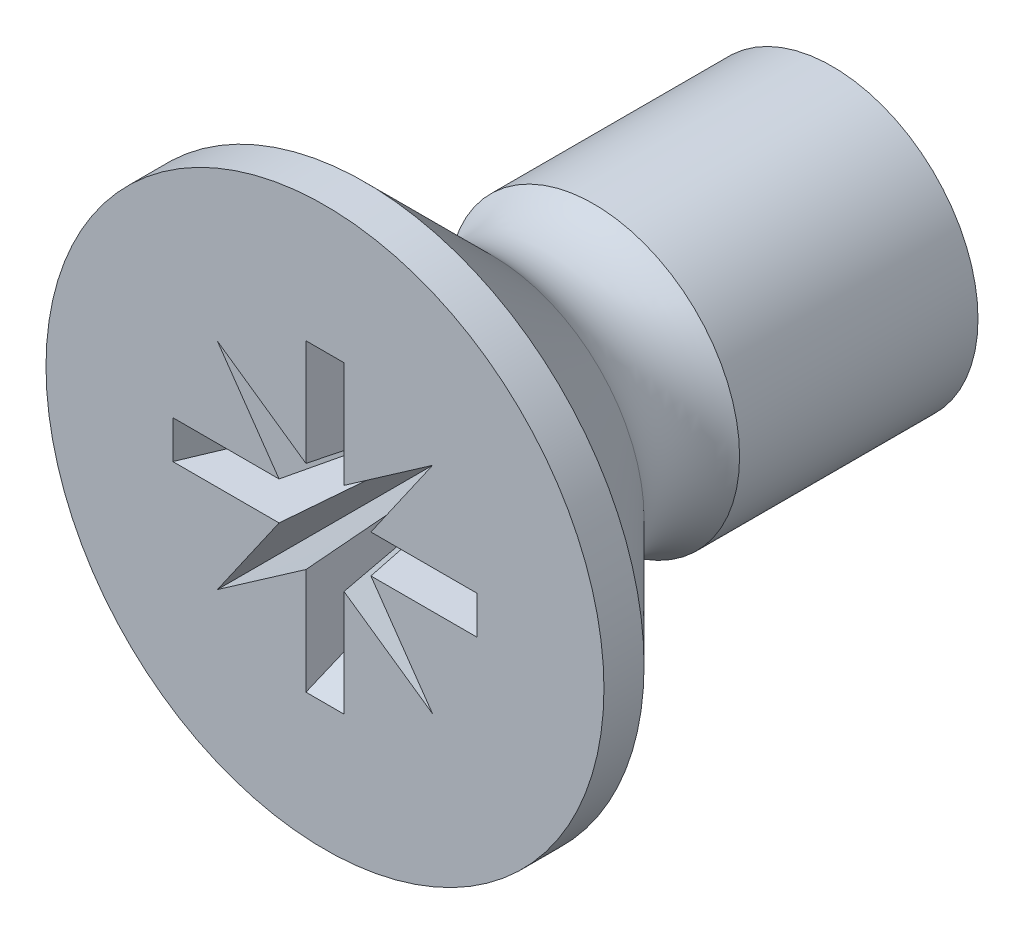
ISO-10303-21;
HEADER;
FILE_DESCRIPTION(('STEP AP214'),'2;1');
FILE_NAME('part.step','',(''),(''),'','','');
FILE_SCHEMA(('AUTOMOTIVE_DESIGN { 1 0 10303 214 1 1 1 1 }'));
ENDSEC;
DATA;
#1=APPLICATION_CONTEXT('core data for automotive mechanical design processes');
#2=APPLICATION_PROTOCOL_DEFINITION('international standard','automotive_design',2000,#1);
#3=PRODUCT_CONTEXT('',#1,'mechanical');
#4=PRODUCT('Part','Part','',(#3));
#5=PRODUCT_RELATED_PRODUCT_CATEGORY('part','',(#4));
#6=PRODUCT_DEFINITION_FORMATION('','',#4);
#7=PRODUCT_DEFINITION_CONTEXT('part definition',#1,'design');
#8=PRODUCT_DEFINITION('design','',#6,#7);
#9=PRODUCT_DEFINITION_SHAPE('','',#8);
#10=(LENGTH_UNIT() NAMED_UNIT(*) SI_UNIT(.MILLI.,.METRE.));
#11=(NAMED_UNIT(*) PLANE_ANGLE_UNIT() SI_UNIT($,.RADIAN.));
#12=(NAMED_UNIT(*) SI_UNIT($,.STERADIAN.) SOLID_ANGLE_UNIT());
#13=UNCERTAINTY_MEASURE_WITH_UNIT(LENGTH_MEASURE(1.E-05),#10,'distance_accuracy_value','');
#14=(GEOMETRIC_REPRESENTATION_CONTEXT(3) GLOBAL_UNCERTAINTY_ASSIGNED_CONTEXT((#13)) GLOBAL_UNIT_ASSIGNED_CONTEXT((#10,
#11,#12)) REPRESENTATION_CONTEXT('',''));
#15=CARTESIAN_POINT('',(0.,0.,0.));
#16=DIRECTION('',(0.,0.,1.));
#17=DIRECTION('',(1.,0.,0.));
#18=AXIS2_PLACEMENT_3D('',#15,#16,#17);
#19=CARTESIAN_POINT('',(0.,0.,-2.18276027382699));
#20=DIRECTION('',(0.,0.,-1.));
#21=DIRECTION('',(-1.,0.,0.));
#22=AXIS2_PLACEMENT_3D('',#19,#20,#21);
#23=TOROIDAL_SURFACE('',#22,2.02806180473974,0.753436804739738);
#24=CARTESIAN_POINT('',(0.,0.,-2.65));
#25=DIRECTION('',(0.,0.,-1.));
#26=DIRECTION('',(-1.,0.,0.));
#27=AXIS2_PLACEMENT_3D('',#24,#25,#26);
#28=CIRCLE('',#27,1.437);
#29=CARTESIAN_POINT('',(-1.437,0.,-2.65));
#30=VERTEX_POINT('',#29);
#31=EDGE_CURVE('E11',#30,#30,#28,.T.);
#32=ORIENTED_EDGE('',*,*,#31,.F.);
#33=EDGE_LOOP('',(#32));
#34=FACE_BOUND('',#33,.T.);
#35=CARTESIAN_POINT('',(0.,0.,-1.65));
#36=DIRECTION('',(0.,0.,-1.));
#37=DIRECTION('',(-1.,0.,0.));
#38=AXIS2_PLACEMENT_3D('',#35,#36,#37);
#39=CIRCLE('',#38,1.49530153091275);
#40=CARTESIAN_POINT('',(-1.49530153091275,0.,-1.65));
#41=VERTEX_POINT('',#40);
#42=EDGE_CURVE('E681',#41,#41,#39,.T.);
#43=ORIENTED_EDGE('',*,*,#42,.T.);
#44=EDGE_LOOP('',(#43));
#45=FACE_BOUND('',#44,.T.);
#46=ADVANCED_FACE('F17',(#34,#45),#23,.F.);
#47=CARTESIAN_POINT('',(0.,0.,0.));
#48=DIRECTION('',(0.,0.,-1.));
#49=DIRECTION('',(-1.,0.,0.));
#50=AXIS2_PLACEMENT_3D('',#47,#48,#49);
#51=CYLINDRICAL_SURFACE('',#50,1.437);
#52=CARTESIAN_POINT('',(0.,0.,-5.));
#53=DIRECTION('',(0.,0.,-1.));
#54=DIRECTION('',(-1.,0.,0.));
#55=AXIS2_PLACEMENT_3D('',#52,#53,#54);
#56=CIRCLE('',#55,1.437);
#57=CARTESIAN_POINT('',(-1.437,0.,-5.));
#58=VERTEX_POINT('',#57);
#59=EDGE_CURVE('E27',#58,#58,#56,.T.);
#60=ORIENTED_EDGE('',*,*,#59,.F.);
#61=EDGE_LOOP('',(#60));
#62=FACE_BOUND('',#61,.T.);
#63=ORIENTED_EDGE('',*,*,#31,.T.);
#64=EDGE_LOOP('',(#63));
#65=FACE_BOUND('',#64,.T.);
#66=ADVANCED_FACE('F671',(#62,#65),#51,.T.);
#67=CARTESIAN_POINT('',(0.,1.437,-5.));
#68=DIRECTION('',(0.,0.,1.));
#69=DIRECTION('',(1.,0.,0.));
#70=AXIS2_PLACEMENT_3D('',#67,#68,#69);
#71=PLANE('',#70);
#72=ORIENTED_EDGE('',*,*,#59,.T.);
#73=EDGE_LOOP('',(#72));
#74=FACE_BOUND('',#73,.T.);
#75=ADVANCED_FACE('F257',(#74),#71,.F.);
#76=CARTESIAN_POINT('',(0.,0.,0.));
#77=DIRECTION('',(0.,0.,-1.));
#78=DIRECTION('',(-1.,0.,0.));
#79=AXIS2_PLACEMENT_3D('',#76,#77,#78);
#80=PLANE('',#79);
#81=DIRECTION('',(0.,-1.,0.));
#82=VECTOR('',#81,1.);
#83=CARTESIAN_POINT('',(0.1875,-0.976332521472478,0.));
#84=LINE('',#83,#82);
#85=CARTESIAN_POINT('',(0.1875,-0.452665042944956,0.));
#86=VERTEX_POINT('',#85);
#87=CARTESIAN_POINT('',(0.1875,-1.5,0.));
#88=VERTEX_POINT('',#87);
#89=EDGE_CURVE('E177',#86,#88,#84,.T.);
#90=ORIENTED_EDGE('',*,*,#89,.T.);
#91=DIRECTION('',(-1.,0.,0.));
#92=VECTOR('',#91,1.);
#93=CARTESIAN_POINT('',(-0.09375,-1.5,0.));
#94=LINE('',#93,#92);
#95=CARTESIAN_POINT('',(-0.1875,-1.5,0.));
#96=VERTEX_POINT('',#95);
#97=EDGE_CURVE('E167',#88,#96,#94,.T.);
#98=ORIENTED_EDGE('',*,*,#97,.T.);
#99=DIRECTION('',(0.,1.,0.));
#100=VECTOR('',#99,1.);
#101=CARTESIAN_POINT('',(-0.1875,-0.976332521472478,0.));
#102=LINE('',#101,#100);
#103=CARTESIAN_POINT('',(-0.1875,-0.452665042944955,0.));
#104=VERTEX_POINT('',#103);
#105=EDGE_CURVE('E41',#96,#104,#102,.T.);
#106=ORIENTED_EDGE('',*,*,#105,.T.);
#107=CARTESIAN_POINT('',(-1.06066017177982,-1.06066017177982,0.));
#108=CARTESIAN_POINT('',(-0.1875,-0.452665042944956,0.));
#109=B_SPLINE_CURVE_WITH_KNOTS('',1,(#107,#108),.UNSPECIFIED.,.F.,.F.,(2,2),(0.,1.),.UNSPECIFIED.);
#110=CARTESIAN_POINT('',(-1.06066017177982,-1.06066017177982,0.));
#111=VERTEX_POINT('',#110);
#112=EDGE_CURVE('E527',#111,#104,#109,.T.);
#113=ORIENTED_EDGE('',*,*,#112,.F.);
#114=CARTESIAN_POINT('',(-0.452665042944956,-0.1875,0.));
#115=CARTESIAN_POINT('',(-1.06066017177982,-1.06066017177982,0.));
#116=B_SPLINE_CURVE_WITH_KNOTS('',1,(#114,#115),.UNSPECIFIED.,.F.,.F.,(2,2),(0.,1.),.UNSPECIFIED.);
#117=CARTESIAN_POINT('',(-0.452665042944956,-0.1875,0.));
#118=VERTEX_POINT('',#117);
#119=EDGE_CURVE('E546',#118,#111,#116,.T.);
#120=ORIENTED_EDGE('',*,*,#119,.F.);
#121=DIRECTION('',(-1.,0.,0.));
#122=VECTOR('',#121,1.);
#123=CARTESIAN_POINT('',(-0.976332521472478,-0.1875,0.));
#124=LINE('',#123,#122);
#125=CARTESIAN_POINT('',(-1.5,-0.1875,0.));
#126=VERTEX_POINT('',#125);
#127=EDGE_CURVE('E549',#118,#126,#124,.T.);
#128=ORIENTED_EDGE('',*,*,#127,.T.);
#129=DIRECTION('',(0.,1.,0.));
#130=VECTOR('',#129,1.);
#131=CARTESIAN_POINT('',(-1.5,-0.09375,0.));
#132=LINE('',#131,#130);
#133=CARTESIAN_POINT('',(-1.5,0.1875,0.));
#134=VERTEX_POINT('',#133);
#135=EDGE_CURVE('E565',#126,#134,#132,.T.);
#136=ORIENTED_EDGE('',*,*,#135,.T.);
#137=DIRECTION('',(1.,0.,0.));
#138=VECTOR('',#137,1.);
#139=CARTESIAN_POINT('',(-0.976332521472478,0.1875,0.));
#140=LINE('',#139,#138);
#141=CARTESIAN_POINT('',(-0.452665042944956,0.1875,0.));
#142=VERTEX_POINT('',#141);
#143=EDGE_CURVE('E588',#134,#142,#140,.T.);
#144=ORIENTED_EDGE('',*,*,#143,.T.);
#145=CARTESIAN_POINT('',(-1.06066017177982,1.06066017177982,0.));
#146=CARTESIAN_POINT('',(-0.452665042944956,0.1875,0.));
#147=B_SPLINE_CURVE_WITH_KNOTS('',1,(#145,#146),.UNSPECIFIED.,.F.,.F.,(2,2),(0.,1.),.UNSPECIFIED.);
#148=CARTESIAN_POINT('',(-1.06066017177982,1.06066017177982,0.));
#149=VERTEX_POINT('',#148);
#150=EDGE_CURVE('E596',#149,#142,#147,.T.);
#151=ORIENTED_EDGE('',*,*,#150,.F.);
#152=CARTESIAN_POINT('',(-0.1875,0.452665042944956,0.));
#153=CARTESIAN_POINT('',(-1.06066017177982,1.06066017177982,0.));
#154=B_SPLINE_CURVE_WITH_KNOTS('',1,(#152,#153),.UNSPECIFIED.,.F.,.F.,(2,2),(0.,1.),.UNSPECIFIED.);
#155=CARTESIAN_POINT('',(-0.1875,0.452665042944956,0.));
#156=VERTEX_POINT('',#155);
#157=EDGE_CURVE('E609',#156,#149,#154,.T.);
#158=ORIENTED_EDGE('',*,*,#157,.F.);
#159=DIRECTION('',(0.,1.,0.));
#160=VECTOR('',#159,1.);
#161=CARTESIAN_POINT('',(-0.1875,0.976332521472478,0.));
#162=LINE('',#161,#160);
#163=CARTESIAN_POINT('',(-0.1875,1.5,0.));
#164=VERTEX_POINT('',#163);
#165=EDGE_CURVE('E612',#156,#164,#162,.T.);
#166=ORIENTED_EDGE('',*,*,#165,.T.);
#167=DIRECTION('',(1.,0.,0.));
#168=VECTOR('',#167,1.);
#169=CARTESIAN_POINT('',(-0.09375,1.5,0.));
#170=LINE('',#169,#168);
#171=CARTESIAN_POINT('',(0.1875,1.5,0.));
#172=VERTEX_POINT('',#171);
#173=EDGE_CURVE('E629',#164,#172,#170,.T.);
#174=ORIENTED_EDGE('',*,*,#173,.T.);
#175=DIRECTION('',(0.,-1.,0.));
#176=VECTOR('',#175,1.);
#177=CARTESIAN_POINT('',(0.1875,0.976332521472478,0.));
#178=LINE('',#177,#176);
#179=CARTESIAN_POINT('',(0.1875,0.452665042944956,0.));
#180=VERTEX_POINT('',#179);
#181=EDGE_CURVE('E326',#172,#180,#178,.T.);
#182=ORIENTED_EDGE('',*,*,#181,.T.);
#183=CARTESIAN_POINT('',(1.06066017177982,1.06066017177982,0.));
#184=CARTESIAN_POINT('',(0.1875,0.452665042944956,0.));
#185=B_SPLINE_CURVE_WITH_KNOTS('',1,(#183,#184),.UNSPECIFIED.,.F.,.F.,(2,2),(0.,1.),.UNSPECIFIED.);
#186=CARTESIAN_POINT('',(1.06066017177982,1.06066017177982,0.));
#187=VERTEX_POINT('',#186);
#188=EDGE_CURVE('E303',#187,#180,#185,.T.);
#189=ORIENTED_EDGE('',*,*,#188,.F.);
#190=CARTESIAN_POINT('',(0.452665042944956,0.1875,0.));
#191=CARTESIAN_POINT('',(1.06066017177982,1.06066017177982,0.));
#192=B_SPLINE_CURVE_WITH_KNOTS('',1,(#190,#191),.UNSPECIFIED.,.F.,.F.,(2,2),(0.,1.),.UNSPECIFIED.);
#193=CARTESIAN_POINT('',(0.452665042944956,0.1875,0.));
#194=VERTEX_POINT('',#193);
#195=EDGE_CURVE('E297',#194,#187,#192,.T.);
#196=ORIENTED_EDGE('',*,*,#195,.F.);
#197=DIRECTION('',(1.,0.,0.));
#198=VECTOR('',#197,1.);
#199=CARTESIAN_POINT('',(0.976332521472478,0.1875,0.));
#200=LINE('',#199,#198);
#201=CARTESIAN_POINT('',(1.5,0.1875,0.));
#202=VERTEX_POINT('',#201);
#203=EDGE_CURVE('E300',#194,#202,#200,.T.);
#204=ORIENTED_EDGE('',*,*,#203,.T.);
#205=DIRECTION('',(0.,-1.,0.));
#206=VECTOR('',#205,1.);
#207=CARTESIAN_POINT('',(1.5,0.09375,0.));
#208=LINE('',#207,#206);
#209=CARTESIAN_POINT('',(1.5,-0.1875,0.));
#210=VERTEX_POINT('',#209);
#211=EDGE_CURVE('E497',#202,#210,#208,.T.);
#212=ORIENTED_EDGE('',*,*,#211,.T.);
#213=DIRECTION('',(-1.,0.,0.));
#214=VECTOR('',#213,1.);
#215=CARTESIAN_POINT('',(0.976332521472478,-0.1875,0.));
#216=LINE('',#215,#214);
#217=CARTESIAN_POINT('',(0.452665042944956,-0.1875,0.));
#218=VERTEX_POINT('',#217);
#219=EDGE_CURVE('E468',#210,#218,#216,.T.);
#220=ORIENTED_EDGE('',*,*,#219,.T.);
#221=CARTESIAN_POINT('',(1.06066017177982,-1.06066017177982,0.));
#222=CARTESIAN_POINT('',(0.452665042944956,-0.1875,0.));
#223=B_SPLINE_CURVE_WITH_KNOTS('',1,(#221,#222),.UNSPECIFIED.,.F.,.F.,(2,2),(0.,1.),.UNSPECIFIED.);
#224=CARTESIAN_POINT('',(1.06066017177982,-1.06066017177982,0.));
#225=VERTEX_POINT('',#224);
#226=EDGE_CURVE('E236',#225,#218,#223,.T.);
#227=ORIENTED_EDGE('',*,*,#226,.F.);
#228=CARTESIAN_POINT('',(0.1875,-0.452665042944956,0.));
#229=CARTESIAN_POINT('',(1.06066017177982,-1.06066017177982,0.));
#230=B_SPLINE_CURVE_WITH_KNOTS('',1,(#228,#229),.UNSPECIFIED.,.F.,.F.,(2,2),(0.,1.),.UNSPECIFIED.);
#231=EDGE_CURVE('E194',#86,#225,#230,.T.);
#232=ORIENTED_EDGE('',*,*,#231,.F.);
#233=EDGE_LOOP('',(#90,#98,#106,#113,#120,#128,#136,#144,#151,#158,#166,#174,#182,#189,#196,
#204,#212,#220,#227,#232));
#234=FACE_BOUND('',#233,.T.);
#235=CARTESIAN_POINT('',(0.,0.,0.));
#236=DIRECTION('',(0.,0.,-1.));
#237=DIRECTION('',(-1.,0.,0.));
#238=AXIS2_PLACEMENT_3D('',#235,#236,#237);
#239=CIRCLE('',#238,2.75);
#240=CARTESIAN_POINT('',(-2.75,0.,0.));
#241=VERTEX_POINT('',#240);
#242=EDGE_CURVE('E686',#241,#241,#239,.T.);
#243=ORIENTED_EDGE('',*,*,#242,.F.);
#244=EDGE_LOOP('',(#243));
#245=FACE_BOUND('',#244,.T.);
#246=ADVANCED_FACE('F238',(#234,#245),#80,.F.);
#247=CARTESIAN_POINT('',(0.,0.,0.));
#248=DIRECTION('',(0.,0.,-1.));
#249=DIRECTION('',(-1.,0.,0.));
#250=AXIS2_PLACEMENT_3D('',#247,#248,#249);
#251=CYLINDRICAL_SURFACE('',#250,2.75);
#252=CARTESIAN_POINT('',(0.,0.,-0.39530153091274));
#253=DIRECTION('',(0.,0.,-1.));
#254=DIRECTION('',(-1.,0.,0.));
#255=AXIS2_PLACEMENT_3D('',#252,#253,#254);
#256=CIRCLE('',#255,2.75);
#257=CARTESIAN_POINT('',(-2.75,0.,-0.39530153091274));
#258=VERTEX_POINT('',#257);
#259=EDGE_CURVE('E683',#258,#258,#256,.T.);
#260=ORIENTED_EDGE('',*,*,#259,.F.);
#261=EDGE_LOOP('',(#260));
#262=FACE_BOUND('',#261,.T.);
#263=ORIENTED_EDGE('',*,*,#242,.T.);
#264=EDGE_LOOP('',(#263));
#265=FACE_BOUND('',#264,.T.);
#266=ADVANCED_FACE('F256',(#262,#265),#251,.T.);
#267=CARTESIAN_POINT('',(0.,0.,-0.39530153091274));
#268=DIRECTION('',(0.,0.,1.));
#269=DIRECTION('',(1.,0.,0.));
#270=AXIS2_PLACEMENT_3D('',#267,#268,#269);
#271=CONICAL_SURFACE('',#270,2.75,0.785398163397446);
#272=ORIENTED_EDGE('',*,*,#42,.F.);
#273=EDGE_LOOP('',(#272));
#274=FACE_BOUND('',#273,.T.);
#275=ORIENTED_EDGE('',*,*,#259,.T.);
#276=EDGE_LOOP('',(#275));
#277=FACE_BOUND('',#276,.T.);
#278=ADVANCED_FACE('F832',(#274,#277),#271,.T.);
#279=CARTESIAN_POINT('',(0.13125,-1.05,-0.88));
#280=DIRECTION('',(-0.997963326741809,0.,0.0637902694650302));
#281=DIRECTION('',(0.0637902694650302,0.,0.997963326741809));
#282=AXIS2_PLACEMENT_3D('',#279,#280,#281);
#283=PLANE('',#282);
#284=CARTESIAN_POINT('',(0.075,-0.181066017177982,-1.76));
#285=CARTESIAN_POINT('',(0.1875,-0.452665042944956,0.));
#286=B_SPLINE_CURVE_WITH_KNOTS('',1,(#284,#285),.UNSPECIFIED.,.F.,.F.,(2,2),(0.,1.),.UNSPECIFIED.);
#287=CARTESIAN_POINT('',(0.075,-0.181066017177982,-1.76));
#288=VERTEX_POINT('',#287);
#289=EDGE_CURVE('E180',#288,#86,#286,.T.);
#290=ORIENTED_EDGE('',*,*,#289,.F.);
#291=DIRECTION('',(0.,-1.,0.));
#292=VECTOR('',#291,1.);
#293=CARTESIAN_POINT('',(0.075,-0.390533008588991,-1.76));
#294=LINE('',#293,#292);
#295=CARTESIAN_POINT('',(0.075,-0.6,-1.76));
#296=VERTEX_POINT('',#295);
#297=EDGE_CURVE('E163',#288,#296,#294,.T.);
#298=ORIENTED_EDGE('',*,*,#297,.T.);
#299=DIRECTION('',(0.0568192235279889,-0.454553788223912,0.888905185860094));
#300=VECTOR('',#299,1.);
#301=CARTESIAN_POINT('',(0.13125,-1.05,-0.88));
#302=LINE('',#301,#300);
#303=EDGE_CURVE('E171',#296,#88,#302,.T.);
#304=ORIENTED_EDGE('',*,*,#303,.T.);
#305=ORIENTED_EDGE('',*,*,#89,.F.);
#306=EDGE_LOOP('',(#290,#298,#304,#305));
#307=FACE_BOUND('',#306,.T.);
#308=ADVANCED_FACE('F179',(#307),#283,.T.);
#309=CARTESIAN_POINT('',(0.419478270999549,-0.41947827099955,-1.76));
#310=CARTESIAN_POINT('',(1.06066017177982,-1.06066017177982,0.));
#311=CARTESIAN_POINT('',(0.075,-0.181066017177982,-1.76));
#312=CARTESIAN_POINT('',(0.1875,-0.452665042944956,0.));
#313=B_SPLINE_SURFACE_WITH_KNOTS('',1,1,((#309,#310),(#311,#312)),.UNSPECIFIED.,.F.,.F.,.F.,(2,
2),(2,2),(0.,1.),(0.,1.),.UNSPECIFIED.);
#314=CARTESIAN_POINT('',(0.419478270999549,-0.41947827099955,-1.76));
#315=CARTESIAN_POINT('',(0.075,-0.181066017177982,-1.76));
#316=B_SPLINE_CURVE_WITH_KNOTS('',1,(#314,#315),.UNSPECIFIED.,.F.,.F.,(2,2),(0.,1.),.UNSPECIFIED.);
#317=CARTESIAN_POINT('',(0.419478270999549,-0.41947827099955,-1.76));
#318=VERTEX_POINT('',#317);
#319=EDGE_CURVE('E235',#318,#288,#316,.T.);
#320=CARTESIAN_POINT('',(0.419478270999549,-0.41947827099955,-1.76));
#321=CARTESIAN_POINT('',(1.06066017177982,-1.06066017177982,0.));
#322=B_SPLINE_CURVE_WITH_KNOTS('',1,(#320,#321),.UNSPECIFIED.,.F.,.F.,(2,2),(0.,1.),.UNSPECIFIED.);
#323=EDGE_CURVE('E476',#318,#225,#322,.T.);
#324=ORIENTED_EDGE('',*,*,#319,.T.);
#325=ORIENTED_EDGE('',*,*,#289,.T.);
#326=ORIENTED_EDGE('',*,*,#231,.T.);
#327=ORIENTED_EDGE('',*,*,#323,.F.);
#328=EDGE_LOOP('',(#324,#325,#326,#327));
#329=FACE_BOUND('',#328,.T.);
#330=ADVANCED_FACE('F201',(#329),#313,.T.);
#331=CARTESIAN_POINT('',(0.181066017177982,-0.075,-1.76));
#332=CARTESIAN_POINT('',(0.452665042944956,-0.1875,0.));
#333=CARTESIAN_POINT('',(0.419478270999549,-0.41947827099955,-1.76));
#334=CARTESIAN_POINT('',(1.06066017177982,-1.06066017177982,0.));
#335=B_SPLINE_SURFACE_WITH_KNOTS('',1,1,((#331,#332),(#333,#334)),.UNSPECIFIED.,.F.,.F.,.F.,(2,
2),(2,2),(0.,1.),(0.,1.),.UNSPECIFIED.);
#336=CARTESIAN_POINT('',(0.181066017177982,-0.075,-1.76));
#337=CARTESIAN_POINT('',(0.419478270999549,-0.41947827099955,-1.76));
#338=B_SPLINE_CURVE_WITH_KNOTS('',1,(#336,#337),.UNSPECIFIED.,.F.,.F.,(2,2),(0.,1.),.UNSPECIFIED.);
#339=CARTESIAN_POINT('',(0.181066017177982,-0.075,-1.76));
#340=VERTEX_POINT('',#339);
#341=EDGE_CURVE('E457',#340,#318,#338,.T.);
#342=DIRECTION('',(0.152208939027645,-0.0630470068596701,0.986335396204615));
#343=VECTOR('',#342,1.);
#344=CARTESIAN_POINT('',(0.316865530061469,-0.13125,-0.88));
#345=LINE('',#344,#343);
#346=EDGE_CURVE('E461',#340,#218,#345,.T.);
#347=ORIENTED_EDGE('',*,*,#341,.T.);
#348=ORIENTED_EDGE('',*,*,#323,.T.);
#349=ORIENTED_EDGE('',*,*,#226,.T.);
#350=ORIENTED_EDGE('',*,*,#346,.F.);
#351=EDGE_LOOP('',(#347,#348,#349,#350));
#352=FACE_BOUND('',#351,.T.);
#353=ADVANCED_FACE('F213',(#352),#335,.T.);
#354=CARTESIAN_POINT('',(1.05,-0.13125,-0.88));
#355=DIRECTION('',(0.,0.997963326741809,0.0637902694650306));
#356=DIRECTION('',(0.,-0.0637902694650306,0.997963326741809));
#357=AXIS2_PLACEMENT_3D('',#354,#355,#356);
#358=PLANE('',#357);
#359=DIRECTION('',(0.454553788223912,-0.056819223527989,0.888905185860094));
#360=VECTOR('',#359,1.);
#361=CARTESIAN_POINT('',(1.05,-0.13125,-0.88));
#362=LINE('',#361,#360);
#363=CARTESIAN_POINT('',(0.6,-0.075,-1.76));
#364=VERTEX_POINT('',#363);
#365=EDGE_CURVE('E500',#364,#210,#362,.T.);
#366=ORIENTED_EDGE('',*,*,#365,.F.);
#367=DIRECTION('',(-1.,0.,0.));
#368=VECTOR('',#367,1.);
#369=CARTESIAN_POINT('',(0.390533008588991,-0.075,-1.76));
#370=LINE('',#369,#368);
#371=EDGE_CURVE('E469',#364,#340,#370,.T.);
#372=ORIENTED_EDGE('',*,*,#371,.T.);
#373=ORIENTED_EDGE('',*,*,#346,.T.);
#374=ORIENTED_EDGE('',*,*,#219,.F.);
#375=EDGE_LOOP('',(#366,#372,#373,#374));
#376=FACE_BOUND('',#375,.T.);
#377=ADVANCED_FACE('F803',(#376),#358,.T.);
#378=CARTESIAN_POINT('',(1.05,0.13125,-0.88));
#379=DIRECTION('',(-0.890343551028259,0.,0.455289315866724));
#380=DIRECTION('',(0.455289315866724,0.,0.89034355102826));
#381=AXIS2_PLACEMENT_3D('',#378,#379,#380);
#382=PLANE('',#381);
#383=DIRECTION('',(0.454553788223912,0.056819223527989,0.888905185860094));
#384=VECTOR('',#383,1.);
#385=CARTESIAN_POINT('',(1.05,0.13125,-0.88));
#386=LINE('',#385,#384);
#387=CARTESIAN_POINT('',(0.6,0.075,-1.76));
#388=VERTEX_POINT('',#387);
#389=EDGE_CURVE('E309',#388,#202,#386,.T.);
#390=ORIENTED_EDGE('',*,*,#389,.F.);
#391=DIRECTION('',(0.,-1.,0.));
#392=VECTOR('',#391,1.);
#393=CARTESIAN_POINT('',(0.6,0.0375,-1.76));
#394=LINE('',#393,#392);
#395=EDGE_CURVE('E502',#388,#364,#394,.T.);
#396=ORIENTED_EDGE('',*,*,#395,.T.);
#397=ORIENTED_EDGE('',*,*,#365,.T.);
#398=ORIENTED_EDGE('',*,*,#211,.F.);
#399=EDGE_LOOP('',(#390,#396,#397,#398));
#400=FACE_BOUND('',#399,.T.);
#401=ADVANCED_FACE('F669',(#400),#382,.T.);
#402=CARTESIAN_POINT('',(1.05,0.13125,-0.88));
#403=DIRECTION('',(0.,-0.997963326741809,0.0637902694650305));
#404=DIRECTION('',(0.,-0.0637902694650305,-0.997963326741809));
#405=AXIS2_PLACEMENT_3D('',#402,#403,#404);
#406=PLANE('',#405);
#407=CARTESIAN_POINT('',(0.181066017177982,0.075,-1.76));
#408=CARTESIAN_POINT('',(0.452665042944956,0.1875,0.));
#409=B_SPLINE_CURVE_WITH_KNOTS('',1,(#407,#408),.UNSPECIFIED.,.F.,.F.,(2,2),(0.,1.),.UNSPECIFIED.);
#410=CARTESIAN_POINT('',(0.181066017177982,0.075,-1.76));
#411=VERTEX_POINT('',#410);
#412=EDGE_CURVE('E306',#411,#194,#409,.T.);
#413=ORIENTED_EDGE('',*,*,#412,.F.);
#414=DIRECTION('',(1.,0.,0.));
#415=VECTOR('',#414,1.);
#416=CARTESIAN_POINT('',(0.390533008588991,0.075,-1.76));
#417=LINE('',#416,#415);
#418=EDGE_CURVE('E311',#411,#388,#417,.T.);
#419=ORIENTED_EDGE('',*,*,#418,.T.);
#420=ORIENTED_EDGE('',*,*,#389,.T.);
#421=ORIENTED_EDGE('',*,*,#203,.F.);
#422=EDGE_LOOP('',(#413,#419,#420,#421));
#423=FACE_BOUND('',#422,.T.);
#424=ADVANCED_FACE('F662',(#423),#406,.T.);
#425=CARTESIAN_POINT('',(0.419478270999549,0.41947827099955,-1.76));
#426=CARTESIAN_POINT('',(1.06066017177982,1.06066017177982,0.));
#427=CARTESIAN_POINT('',(0.181066017177982,0.075,-1.76));
#428=CARTESIAN_POINT('',(0.452665042944956,0.1875,0.));
#429=B_SPLINE_SURFACE_WITH_KNOTS('',1,1,((#425,#426),(#427,#428)),.UNSPECIFIED.,.F.,.F.,.F.,(2,
2),(2,2),(0.,1.),(0.,1.),.UNSPECIFIED.);
#430=CARTESIAN_POINT('',(0.419478270999549,0.41947827099955,-1.76));
#431=CARTESIAN_POINT('',(0.181066017177982,0.075,-1.76));
#432=B_SPLINE_CURVE_WITH_KNOTS('',1,(#430,#431),.UNSPECIFIED.,.F.,.F.,(2,2),(0.,1.),.UNSPECIFIED.);
#433=CARTESIAN_POINT('',(0.419478270999549,0.41947827099955,-1.76));
#434=VERTEX_POINT('',#433);
#435=EDGE_CURVE('E307',#434,#411,#432,.T.);
#436=CARTESIAN_POINT('',(0.419478270999549,0.41947827099955,-1.76));
#437=CARTESIAN_POINT('',(1.06066017177982,1.06066017177982,0.));
#438=B_SPLINE_CURVE_WITH_KNOTS('',1,(#436,#437),.UNSPECIFIED.,.F.,.F.,(2,2),(0.,1.),.UNSPECIFIED.);
#439=EDGE_CURVE('E374',#434,#187,#438,.T.);
#440=ORIENTED_EDGE('',*,*,#435,.T.);
#441=ORIENTED_EDGE('',*,*,#412,.T.);
#442=ORIENTED_EDGE('',*,*,#195,.T.);
#443=ORIENTED_EDGE('',*,*,#439,.F.);
#444=EDGE_LOOP('',(#440,#441,#442,#443));
#445=FACE_BOUND('',#444,.T.);
#446=ADVANCED_FACE('F340',(#445),#429,.T.);
#447=CARTESIAN_POINT('',(0.075,0.181066017177982,-1.76));
#448=CARTESIAN_POINT('',(0.1875,0.452665042944956,0.));
#449=CARTESIAN_POINT('',(0.419478270999549,0.41947827099955,-1.76));
#450=CARTESIAN_POINT('',(1.06066017177982,1.06066017177982,0.));
#451=B_SPLINE_SURFACE_WITH_KNOTS('',1,1,((#447,#448),(#449,#450)),.UNSPECIFIED.,.F.,.F.,.F.,(2,
2),(2,2),(0.,1.),(0.,1.),.UNSPECIFIED.);
#452=CARTESIAN_POINT('',(0.075,0.181066017177982,-1.76));
#453=CARTESIAN_POINT('',(0.419478270999549,0.41947827099955,-1.76));
#454=B_SPLINE_CURVE_WITH_KNOTS('',1,(#452,#453),.UNSPECIFIED.,.F.,.F.,(2,2),(0.,1.),.UNSPECIFIED.);
#455=CARTESIAN_POINT('',(0.075,0.181066017177982,-1.76));
#456=VERTEX_POINT('',#455);
#457=EDGE_CURVE('E371',#456,#434,#454,.T.);
#458=DIRECTION('',(0.06304700685967,0.152208939027645,0.986335396204615));
#459=VECTOR('',#458,1.);
#460=CARTESIAN_POINT('',(0.13125,0.316865530061469,-0.88));
#461=LINE('',#460,#459);
#462=EDGE_CURVE('E359',#456,#180,#461,.T.);
#463=ORIENTED_EDGE('',*,*,#457,.T.);
#464=ORIENTED_EDGE('',*,*,#439,.T.);
#465=ORIENTED_EDGE('',*,*,#188,.T.);
#466=ORIENTED_EDGE('',*,*,#462,.F.);
#467=EDGE_LOOP('',(#463,#464,#465,#466));
#468=FACE_BOUND('',#467,.T.);
#469=ADVANCED_FACE('F328',(#468),#451,.T.);
#470=CARTESIAN_POINT('',(0.13125,1.05,-0.88));
#471=DIRECTION('',(-0.997963326741809,0.,0.0637902694650304));
#472=DIRECTION('',(0.0637902694650304,0.,0.997963326741809));
#473=AXIS2_PLACEMENT_3D('',#470,#471,#472);
#474=PLANE('',#473);
#475=DIRECTION('',(0.0568192235279889,0.454553788223912,0.888905185860094));
#476=VECTOR('',#475,1.);
#477=CARTESIAN_POINT('',(0.13125,1.05,-0.88));
#478=LINE('',#477,#476);
#479=CARTESIAN_POINT('',(0.075,0.6,-1.76));
#480=VERTEX_POINT('',#479);
#481=EDGE_CURVE('E636',#480,#172,#478,.T.);
#482=ORIENTED_EDGE('',*,*,#481,.F.);
#483=DIRECTION('',(0.,-1.,0.));
#484=VECTOR('',#483,1.);
#485=CARTESIAN_POINT('',(0.075,0.390533008588991,-1.76));
#486=LINE('',#485,#484);
#487=EDGE_CURVE('E366',#480,#456,#486,.T.);
#488=ORIENTED_EDGE('',*,*,#487,.T.);
#489=ORIENTED_EDGE('',*,*,#462,.T.);
#490=ORIENTED_EDGE('',*,*,#181,.F.);
#491=EDGE_LOOP('',(#482,#488,#489,#490));
#492=FACE_BOUND('',#491,.T.);
#493=ADVANCED_FACE('F339',(#492),#474,.T.);
#494=CARTESIAN_POINT('',(-0.13125,1.05,-0.88));
#495=DIRECTION('',(0.,-0.890343551028259,0.455289315866724));
#496=DIRECTION('',(0.,-0.455289315866724,-0.89034355102826));
#497=AXIS2_PLACEMENT_3D('',#494,#495,#496);
#498=PLANE('',#497);
#499=DIRECTION('',(-0.0568192235279889,0.454553788223912,0.888905185860094));
#500=VECTOR('',#499,1.);
#501=CARTESIAN_POINT('',(-0.13125,1.05,-0.88));
#502=LINE('',#501,#500);
#503=CARTESIAN_POINT('',(-0.075,0.6,-1.76));
#504=VERTEX_POINT('',#503);
#505=EDGE_CURVE('E628',#504,#164,#502,.T.);
#506=ORIENTED_EDGE('',*,*,#505,.F.);
#507=DIRECTION('',(1.,0.,0.));
#508=VECTOR('',#507,1.);
#509=CARTESIAN_POINT('',(-0.0375,0.6,-1.76));
#510=LINE('',#509,#508);
#511=EDGE_CURVE('E640',#504,#480,#510,.T.);
#512=ORIENTED_EDGE('',*,*,#511,.T.);
#513=ORIENTED_EDGE('',*,*,#481,.T.);
#514=ORIENTED_EDGE('',*,*,#173,.F.);
#515=EDGE_LOOP('',(#506,#512,#513,#514));
#516=FACE_BOUND('',#515,.T.);
#517=ADVANCED_FACE('F732',(#516),#498,.T.);
#518=CARTESIAN_POINT('',(-0.13125,1.05,-0.88));
#519=DIRECTION('',(0.997963326741809,0.,0.0637902694650306));
#520=DIRECTION('',(0.0637902694650306,0.,-0.997963326741809));
#521=AXIS2_PLACEMENT_3D('',#518,#519,#520);
#522=PLANE('',#521);
#523=CARTESIAN_POINT('',(-0.075,0.181066017177982,-1.76));
#524=CARTESIAN_POINT('',(-0.1875,0.452665042944956,0.));
#525=B_SPLINE_CURVE_WITH_KNOTS('',1,(#523,#524),.UNSPECIFIED.,.F.,.F.,(2,2),(0.,1.),.UNSPECIFIED.);
#526=CARTESIAN_POINT('',(-0.075,0.181066017177982,-1.76));
#527=VERTEX_POINT('',#526);
#528=EDGE_CURVE('E607',#527,#156,#525,.T.);
#529=ORIENTED_EDGE('',*,*,#528,.F.);
#530=DIRECTION('',(0.,1.,0.));
#531=VECTOR('',#530,1.);
#532=CARTESIAN_POINT('',(-0.075,0.390533008588991,-1.76));
#533=LINE('',#532,#531);
#534=EDGE_CURVE('E622',#527,#504,#533,.T.);
#535=ORIENTED_EDGE('',*,*,#534,.T.);
#536=ORIENTED_EDGE('',*,*,#505,.T.);
#537=ORIENTED_EDGE('',*,*,#165,.F.);
#538=EDGE_LOOP('',(#529,#535,#536,#537));
#539=FACE_BOUND('',#538,.T.);
#540=ADVANCED_FACE('F734',(#539),#522,.T.);
#541=CARTESIAN_POINT('',(-0.419478270999549,0.41947827099955,-1.76));
#542=CARTESIAN_POINT('',(-1.06066017177982,1.06066017177982,0.));
#543=CARTESIAN_POINT('',(-0.075,0.181066017177982,-1.76));
#544=CARTESIAN_POINT('',(-0.1875,0.452665042944956,0.));
#545=B_SPLINE_SURFACE_WITH_KNOTS('',1,1,((#541,#542),(#543,#544)),.UNSPECIFIED.,.F.,.F.,.F.,(2,
2),(2,2),(0.,1.),(0.,1.),.UNSPECIFIED.);
#546=CARTESIAN_POINT('',(-0.419478270999549,0.41947827099955,-1.76));
#547=CARTESIAN_POINT('',(-0.075,0.181066017177982,-1.76));
#548=B_SPLINE_CURVE_WITH_KNOTS('',1,(#546,#547),.UNSPECIFIED.,.F.,.F.,(2,2),(0.,1.),.UNSPECIFIED.);
#549=CARTESIAN_POINT('',(-0.419478270999549,0.41947827099955,-1.76));
#550=VERTEX_POINT('',#549);
#551=EDGE_CURVE('E577',#550,#527,#548,.T.);
#552=CARTESIAN_POINT('',(-0.419478270999549,0.41947827099955,-1.76));
#553=CARTESIAN_POINT('',(-1.06066017177982,1.06066017177982,0.));
#554=B_SPLINE_CURVE_WITH_KNOTS('',1,(#552,#553),.UNSPECIFIED.,.F.,.F.,(2,2),(0.,1.),.UNSPECIFIED.);
#555=EDGE_CURVE('E579',#550,#149,#554,.T.);
#556=ORIENTED_EDGE('',*,*,#551,.T.);
#557=ORIENTED_EDGE('',*,*,#528,.T.);
#558=ORIENTED_EDGE('',*,*,#157,.T.);
#559=ORIENTED_EDGE('',*,*,#555,.F.);
#560=EDGE_LOOP('',(#556,#557,#558,#559));
#561=FACE_BOUND('',#560,.T.);
#562=ADVANCED_FACE('F737',(#561),#545,.T.);
#563=CARTESIAN_POINT('',(-0.181066017177982,0.075,-1.76));
#564=CARTESIAN_POINT('',(-0.452665042944956,0.1875,0.));
#565=CARTESIAN_POINT('',(-0.419478270999549,0.41947827099955,-1.76));
#566=CARTESIAN_POINT('',(-1.06066017177982,1.06066017177982,0.));
#567=B_SPLINE_SURFACE_WITH_KNOTS('',1,1,((#563,#564),(#565,#566)),.UNSPECIFIED.,.F.,.F.,.F.,(2,
2),(2,2),(0.,1.),(0.,1.),.UNSPECIFIED.);
#568=CARTESIAN_POINT('',(-0.181066017177982,0.075,-1.76));
#569=CARTESIAN_POINT('',(-0.419478270999549,0.41947827099955,-1.76));
#570=B_SPLINE_CURVE_WITH_KNOTS('',1,(#568,#569),.UNSPECIFIED.,.F.,.F.,(2,2),(0.,1.),.UNSPECIFIED.);
#571=CARTESIAN_POINT('',(-0.181066017177982,0.075,-1.76));
#572=VERTEX_POINT('',#571);
#573=EDGE_CURVE('E571',#572,#550,#570,.T.);
#574=DIRECTION('',(-0.152208939027645,0.0630470068596701,0.986335396204615));
#575=VECTOR('',#574,1.);
#576=CARTESIAN_POINT('',(-0.316865530061469,0.13125,-0.88));
#577=LINE('',#576,#575);
#578=EDGE_CURVE('E584',#572,#142,#577,.T.);
#579=ORIENTED_EDGE('',*,*,#573,.T.);
#580=ORIENTED_EDGE('',*,*,#555,.T.);
#581=ORIENTED_EDGE('',*,*,#150,.T.);
#582=ORIENTED_EDGE('',*,*,#578,.F.);
#583=EDGE_LOOP('',(#579,#580,#581,#582));
#584=FACE_BOUND('',#583,.T.);
#585=ADVANCED_FACE('F754',(#584),#567,.T.);
#586=CARTESIAN_POINT('',(-1.05,0.13125,-0.88));
#587=DIRECTION('',(0.,-0.997963326741809,0.0637902694650306));
#588=DIRECTION('',(0.,-0.0637902694650306,-0.997963326741809));
#589=AXIS2_PLACEMENT_3D('',#586,#587,#588);
#590=PLANE('',#589);
#591=DIRECTION('',(-0.454553788223912,0.056819223527989,0.888905185860094));
#592=VECTOR('',#591,1.);
#593=CARTESIAN_POINT('',(-1.05,0.13125,-0.88));
#594=LINE('',#593,#592);
#595=CARTESIAN_POINT('',(-0.6,0.075,-1.76));
#596=VERTEX_POINT('',#595);
#597=EDGE_CURVE('E586',#596,#134,#594,.T.);
#598=ORIENTED_EDGE('',*,*,#597,.F.);
#599=DIRECTION('',(1.,0.,0.));
#600=VECTOR('',#599,1.);
#601=CARTESIAN_POINT('',(-0.390533008588991,0.075,-1.76));
#602=LINE('',#601,#600);
#603=EDGE_CURVE('E574',#596,#572,#602,.T.);
#604=ORIENTED_EDGE('',*,*,#603,.T.);
#605=ORIENTED_EDGE('',*,*,#578,.T.);
#606=ORIENTED_EDGE('',*,*,#143,.F.);
#607=EDGE_LOOP('',(#598,#604,#605,#606));
#608=FACE_BOUND('',#607,.T.);
#609=ADVANCED_FACE('F582',(#608),#590,.T.);
#610=CARTESIAN_POINT('',(-1.05,-0.13125,-0.88));
#611=DIRECTION('',(0.890343551028259,0.,0.455289315866724));
#612=DIRECTION('',(0.455289315866724,0.,-0.89034355102826));
#613=AXIS2_PLACEMENT_3D('',#610,#611,#612);
#614=PLANE('',#613);
#615=DIRECTION('',(-0.454553788223912,-0.056819223527989,0.888905185860094));
#616=VECTOR('',#615,1.);
#617=CARTESIAN_POINT('',(-1.05,-0.13125,-0.88));
#618=LINE('',#617,#616);
#619=CARTESIAN_POINT('',(-0.6,-0.075,-1.76));
#620=VERTEX_POINT('',#619);
#621=EDGE_CURVE('E564',#620,#126,#618,.T.);
#622=ORIENTED_EDGE('',*,*,#621,.F.);
#623=DIRECTION('',(0.,1.,0.));
#624=VECTOR('',#623,1.);
#625=CARTESIAN_POINT('',(-0.6,-0.0375,-1.76));
#626=LINE('',#625,#624);
#627=EDGE_CURVE('E727',#620,#596,#626,.T.);
#628=ORIENTED_EDGE('',*,*,#627,.T.);
#629=ORIENTED_EDGE('',*,*,#597,.T.);
#630=ORIENTED_EDGE('',*,*,#135,.F.);
#631=EDGE_LOOP('',(#622,#628,#629,#630));
#632=FACE_BOUND('',#631,.T.);
#633=ADVANCED_FACE('F911',(#632),#614,.T.);
#634=CARTESIAN_POINT('',(-1.05,-0.13125,-0.88));
#635=DIRECTION('',(0.,0.997963326741809,0.0637902694650305));
#636=DIRECTION('',(0.,-0.0637902694650305,0.997963326741809));
#637=AXIS2_PLACEMENT_3D('',#634,#635,#636);
#638=PLANE('',#637);
#639=CARTESIAN_POINT('',(-0.181066017177982,-0.075,-1.76));
#640=CARTESIAN_POINT('',(-0.452665042944956,-0.1875,0.));
#641=B_SPLINE_CURVE_WITH_KNOTS('',1,(#639,#640),.UNSPECIFIED.,.F.,.F.,(2,2),(0.,1.),.UNSPECIFIED.);
#642=CARTESIAN_POINT('',(-0.181066017177982,-0.075,-1.76));
#643=VERTEX_POINT('',#642);
#644=EDGE_CURVE('E544',#643,#118,#641,.T.);
#645=ORIENTED_EDGE('',*,*,#644,.F.);
#646=DIRECTION('',(-1.,0.,0.));
#647=VECTOR('',#646,1.);
#648=CARTESIAN_POINT('',(-0.390533008588991,-0.075,-1.76));
#649=LINE('',#648,#647);
#650=EDGE_CURVE('E558',#643,#620,#649,.T.);
#651=ORIENTED_EDGE('',*,*,#650,.T.);
#652=ORIENTED_EDGE('',*,*,#621,.T.);
#653=ORIENTED_EDGE('',*,*,#127,.F.);
#654=EDGE_LOOP('',(#645,#651,#652,#653));
#655=FACE_BOUND('',#654,.T.);
#656=ADVANCED_FACE('F918',(#655),#638,.T.);
#657=CARTESIAN_POINT('',(-0.419478270999549,-0.41947827099955,-1.76));
#658=CARTESIAN_POINT('',(-1.06066017177982,-1.06066017177982,0.));
#659=CARTESIAN_POINT('',(-0.181066017177982,-0.075,-1.76));
#660=CARTESIAN_POINT('',(-0.452665042944956,-0.1875,0.));
#661=B_SPLINE_SURFACE_WITH_KNOTS('',1,1,((#657,#658),(#659,#660)),.UNSPECIFIED.,.F.,.F.,.F.,(2,
2),(2,2),(0.,1.),(0.,1.),.UNSPECIFIED.);
#662=CARTESIAN_POINT('',(-0.419478270999549,-0.41947827099955,-1.76));
#663=CARTESIAN_POINT('',(-0.181066017177982,-0.075,-1.76));
#664=B_SPLINE_CURVE_WITH_KNOTS('',1,(#662,#663),.UNSPECIFIED.,.F.,.F.,(2,2),(0.,1.),.UNSPECIFIED.);
#665=CARTESIAN_POINT('',(-0.419478270999549,-0.41947827099955,-1.76));
#666=VERTEX_POINT('',#665);
#667=EDGE_CURVE('E519',#666,#643,#664,.T.);
#668=CARTESIAN_POINT('',(-0.419478270999549,-0.41947827099955,-1.76));
#669=CARTESIAN_POINT('',(-1.06066017177982,-1.06066017177982,0.));
#670=B_SPLINE_CURVE_WITH_KNOTS('',1,(#668,#669),.UNSPECIFIED.,.F.,.F.,(2,2),(0.,1.),.UNSPECIFIED.);
#671=EDGE_CURVE('E522',#666,#111,#670,.T.);
#672=ORIENTED_EDGE('',*,*,#667,.T.);
#673=ORIENTED_EDGE('',*,*,#644,.T.);
#674=ORIENTED_EDGE('',*,*,#119,.T.);
#675=ORIENTED_EDGE('',*,*,#671,.F.);
#676=EDGE_LOOP('',(#672,#673,#674,#675));
#677=FACE_BOUND('',#676,.T.);
#678=ADVANCED_FACE('F403',(#677),#661,.T.);
#679=CARTESIAN_POINT('',(0.,0.,-1.76));
#680=DIRECTION('',(0.,0.,-1.));
#681=DIRECTION('',(-1.,0.,0.));
#682=AXIS2_PLACEMENT_3D('',#679,#680,#681);
#683=PLANE('',#682);
#684=ORIENTED_EDGE('',*,*,#297,.F.);
#685=ORIENTED_EDGE('',*,*,#319,.F.);
#686=ORIENTED_EDGE('',*,*,#341,.F.);
#687=ORIENTED_EDGE('',*,*,#371,.F.);
#688=ORIENTED_EDGE('',*,*,#395,.F.);
#689=ORIENTED_EDGE('',*,*,#418,.F.);
#690=ORIENTED_EDGE('',*,*,#435,.F.);
#691=ORIENTED_EDGE('',*,*,#457,.F.);
#692=ORIENTED_EDGE('',*,*,#487,.F.);
#693=ORIENTED_EDGE('',*,*,#511,.F.);
#694=ORIENTED_EDGE('',*,*,#534,.F.);
#695=ORIENTED_EDGE('',*,*,#551,.F.);
#696=ORIENTED_EDGE('',*,*,#573,.F.);
#697=ORIENTED_EDGE('',*,*,#603,.F.);
#698=ORIENTED_EDGE('',*,*,#627,.F.);
#699=ORIENTED_EDGE('',*,*,#650,.F.);
#700=ORIENTED_EDGE('',*,*,#667,.F.);
#701=CARTESIAN_POINT('',(-0.075,-0.181066017177982,-1.76));
#702=CARTESIAN_POINT('',(-0.419478270999549,-0.41947827099955,-1.76));
#703=B_SPLINE_CURVE_WITH_KNOTS('',1,(#701,#702),.UNSPECIFIED.,.F.,.F.,(2,2),(0.,1.),.UNSPECIFIED.);
#704=CARTESIAN_POINT('',(-0.075,-0.181066017177982,-1.76));
#705=VERTEX_POINT('',#704);
#706=EDGE_CURVE('E168',#705,#666,#703,.T.);
#707=ORIENTED_EDGE('',*,*,#706,.F.);
#708=DIRECTION('',(0.,1.,0.));
#709=VECTOR('',#708,1.);
#710=CARTESIAN_POINT('',(-0.075,-0.390533008588991,-1.76));
#711=LINE('',#710,#709);
#712=CARTESIAN_POINT('',(-0.075,-0.6,-1.76));
#713=VERTEX_POINT('',#712);
#714=EDGE_CURVE('E165',#713,#705,#711,.T.);
#715=ORIENTED_EDGE('',*,*,#714,.F.);
#716=DIRECTION('',(-1.,0.,0.));
#717=VECTOR('',#716,1.);
#718=CARTESIAN_POINT('',(-0.0375,-0.6,-1.76));
#719=LINE('',#718,#717);
#720=EDGE_CURVE('E158',#296,#713,#719,.T.);
#721=ORIENTED_EDGE('',*,*,#720,.F.);
#722=EDGE_LOOP('',(#684,#685,#686,#687,#688,#689,#690,#691,#692,#693,#694,#695,#696,#697,#698,
#699,#700,#707,#715,#721));
#723=FACE_BOUND('',#722,.T.);
#724=ADVANCED_FACE('F160',(#723),#683,.F.);
#725=CARTESIAN_POINT('',(-0.075,-0.181066017177982,-1.76));
#726=CARTESIAN_POINT('',(-0.1875,-0.452665042944956,0.));
#727=CARTESIAN_POINT('',(-0.419478270999549,-0.41947827099955,-1.76));
#728=CARTESIAN_POINT('',(-1.06066017177982,-1.06066017177982,0.));
#729=B_SPLINE_SURFACE_WITH_KNOTS('',1,1,((#725,#726),(#727,#728)),.UNSPECIFIED.,.F.,.F.,.F.,(2,
2),(2,2),(0.,1.),(0.,1.),.UNSPECIFIED.);
#730=DIRECTION('',(-0.0630470068596699,-0.152208939027645,0.986335396204615));
#731=VECTOR('',#730,1.);
#732=CARTESIAN_POINT('',(-0.13125,-0.316865530061469,-0.88));
#733=LINE('',#732,#731);
#734=EDGE_CURVE('E35',#705,#104,#733,.T.);
#735=ORIENTED_EDGE('',*,*,#706,.T.);
#736=ORIENTED_EDGE('',*,*,#671,.T.);
#737=ORIENTED_EDGE('',*,*,#112,.T.);
#738=ORIENTED_EDGE('',*,*,#734,.F.);
#739=EDGE_LOOP('',(#735,#736,#737,#738));
#740=FACE_BOUND('',#739,.T.);
#741=ADVANCED_FACE('F402',(#740),#729,.T.);
#742=CARTESIAN_POINT('',(-0.13125,-1.05,-0.88));
#743=DIRECTION('',(0.,0.890343551028259,0.455289315866724));
#744=DIRECTION('',(0.,-0.455289315866724,0.89034355102826));
#745=AXIS2_PLACEMENT_3D('',#742,#743,#744);
#746=PLANE('',#745);
#747=ORIENTED_EDGE('',*,*,#720,.T.);
#748=DIRECTION('',(-0.0568192235279889,-0.454553788223912,0.888905185860094));
#749=VECTOR('',#748,1.);
#750=CARTESIAN_POINT('',(-0.13125,-1.05,-0.88));
#751=LINE('',#750,#749);
#752=EDGE_CURVE('E524',#713,#96,#751,.T.);
#753=ORIENTED_EDGE('',*,*,#752,.T.);
#754=ORIENTED_EDGE('',*,*,#97,.F.);
#755=ORIENTED_EDGE('',*,*,#303,.F.);
#756=EDGE_LOOP('',(#747,#753,#754,#755));
#757=FACE_BOUND('',#756,.T.);
#758=ADVANCED_FACE('F172',(#757),#746,.T.);
#759=CARTESIAN_POINT('',(-0.13125,-1.05,-0.88));
#760=DIRECTION('',(0.997963326741809,0.,0.0637902694650302));
#761=DIRECTION('',(0.0637902694650302,0.,-0.997963326741809));
#762=AXIS2_PLACEMENT_3D('',#759,#760,#761);
#763=PLANE('',#762);
#764=ORIENTED_EDGE('',*,*,#752,.F.);
#765=ORIENTED_EDGE('',*,*,#714,.T.);
#766=ORIENTED_EDGE('',*,*,#734,.T.);
#767=ORIENTED_EDGE('',*,*,#105,.F.);
#768=EDGE_LOOP('',(#764,#765,#766,#767));
#769=FACE_BOUND('',#768,.T.);
#770=ADVANCED_FACE('F523',(#769),#763,.T.);
#771=CLOSED_SHELL('',(#46,#66,#75,#246,#266,#278,#308,#330,#353,#377,#401,#424,#446,#469,#493,
#517,#540,#562,#585,#609,#633,#656,#678,#724,#741,#758,#770));
#772=MANIFOLD_SOLID_BREP('B1',#771);
#773=ADVANCED_BREP_SHAPE_REPRESENTATION('',(#18,#772),#14);
#774=SHAPE_DEFINITION_REPRESENTATION(#9,#773);
ENDSEC;
END-ISO-10303-21;
